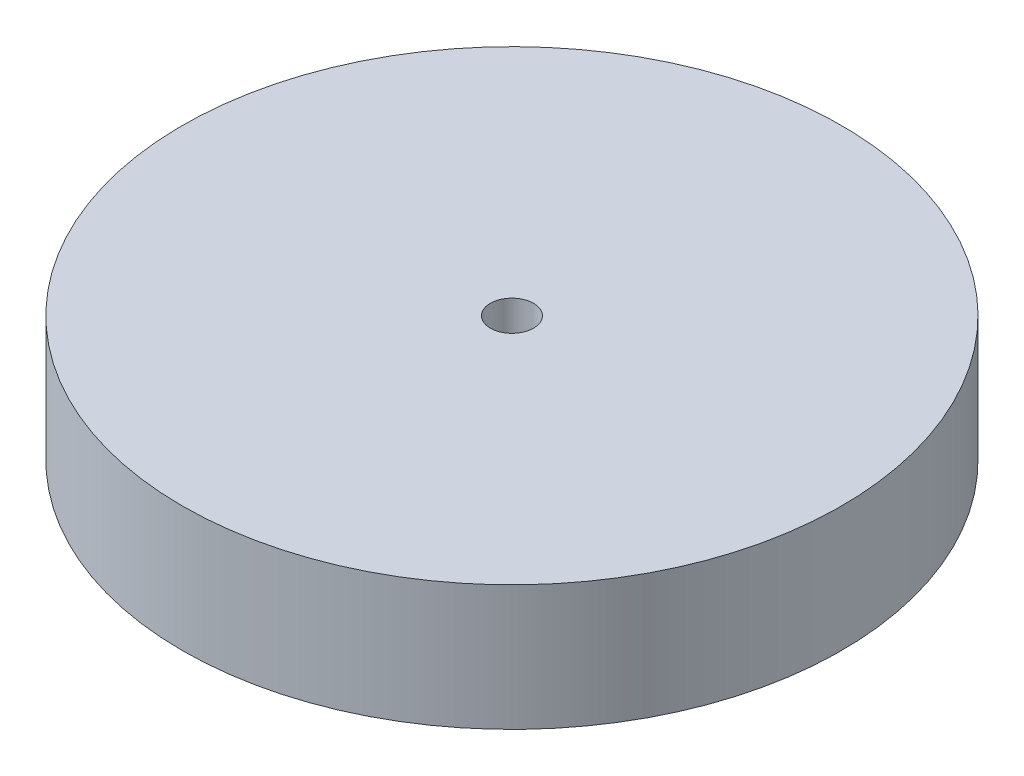
ISO-10303-21;
HEADER;
FILE_DESCRIPTION(('STEP AP214'),'2;1');
FILE_NAME('part.step','',(''),(''),'','','');
FILE_SCHEMA(('AUTOMOTIVE_DESIGN { 1 0 10303 214 1 1 1 1 }'));
ENDSEC;
DATA;
#1=APPLICATION_CONTEXT('core data for automotive mechanical design processes');
#2=APPLICATION_PROTOCOL_DEFINITION('international standard','automotive_design',2000,#1);
#3=PRODUCT_CONTEXT('',#1,'mechanical');
#4=PRODUCT('Part','Part','',(#3));
#5=PRODUCT_RELATED_PRODUCT_CATEGORY('part','',(#4));
#6=PRODUCT_DEFINITION_FORMATION('','',#4);
#7=PRODUCT_DEFINITION_CONTEXT('part definition',#1,'design');
#8=PRODUCT_DEFINITION('design','',#6,#7);
#9=PRODUCT_DEFINITION_SHAPE('','',#8);
#10=(LENGTH_UNIT() NAMED_UNIT(*) SI_UNIT(.MILLI.,.METRE.));
#11=(NAMED_UNIT(*) PLANE_ANGLE_UNIT() SI_UNIT($,.RADIAN.));
#12=(NAMED_UNIT(*) SI_UNIT($,.STERADIAN.) SOLID_ANGLE_UNIT());
#13=UNCERTAINTY_MEASURE_WITH_UNIT(LENGTH_MEASURE(1.E-05),#10,'distance_accuracy_value','');
#14=(GEOMETRIC_REPRESENTATION_CONTEXT(3) GLOBAL_UNCERTAINTY_ASSIGNED_CONTEXT((#13)) GLOBAL_UNIT_ASSIGNED_CONTEXT((#10,
#11,#12)) REPRESENTATION_CONTEXT('',''));
#15=CARTESIAN_POINT('',(0.,0.,0.));
#16=DIRECTION('',(0.,0.,1.));
#17=DIRECTION('',(1.,0.,0.));
#18=AXIS2_PLACEMENT_3D('',#15,#16,#17);
#19=CARTESIAN_POINT('',(0.,19.,0.));
#20=DIRECTION('',(0.,-1.,0.));
#21=DIRECTION('',(0.,0.,-1.));
#22=AXIS2_PLACEMENT_3D('',#19,#20,#21);
#23=CYLINDRICAL_SURFACE('',#22,50.);
#24=CARTESIAN_POINT('',(0.,19.,0.));
#25=DIRECTION('',(0.,1.,0.));
#26=DIRECTION('',(0.,0.,1.));
#27=AXIS2_PLACEMENT_3D('',#24,#25,#26);
#28=CIRCLE('',#27,50.);
#29=CARTESIAN_POINT('',(0.,19.,50.));
#30=VERTEX_POINT('',#29);
#31=EDGE_CURVE('E10',#30,#30,#28,.T.);
#32=ORIENTED_EDGE('',*,*,#31,.F.);
#33=EDGE_LOOP('',(#32));
#34=FACE_BOUND('',#33,.T.);
#35=CARTESIAN_POINT('',(0.,0.,0.));
#36=DIRECTION('',(0.,1.,0.));
#37=DIRECTION('',(0.,0.,1.));
#38=AXIS2_PLACEMENT_3D('',#35,#36,#37);
#39=CIRCLE('',#38,50.);
#40=CARTESIAN_POINT('',(0.,0.,50.));
#41=VERTEX_POINT('',#40);
#42=EDGE_CURVE('E36',#41,#41,#39,.T.);
#43=ORIENTED_EDGE('',*,*,#42,.T.);
#44=EDGE_LOOP('',(#43));
#45=FACE_BOUND('',#44,.T.);
#46=ADVANCED_FACE('F33',(#34,#45),#23,.T.);
#47=CARTESIAN_POINT('',(0.,19.,0.));
#48=DIRECTION('',(0.,1.,0.));
#49=DIRECTION('',(0.,0.,1.));
#50=AXIS2_PLACEMENT_3D('',#47,#48,#49);
#51=PLANE('',#50);
#52=CARTESIAN_POINT('',(0.,19.,0.));
#53=DIRECTION('',(0.,1.,0.));
#54=DIRECTION('',(0.,0.,1.));
#55=AXIS2_PLACEMENT_3D('',#52,#53,#54);
#56=CIRCLE('',#55,3.275);
#57=CARTESIAN_POINT('',(0.,19.,3.275));
#58=VERTEX_POINT('',#57);
#59=EDGE_CURVE('E45',#58,#58,#56,.T.);
#60=ORIENTED_EDGE('',*,*,#59,.F.);
#61=EDGE_LOOP('',(#60));
#62=FACE_BOUND('',#61,.T.);
#63=ORIENTED_EDGE('',*,*,#31,.T.);
#64=EDGE_LOOP('',(#63));
#65=FACE_BOUND('',#64,.T.);
#66=ADVANCED_FACE('F60',(#62,#65),#51,.T.);
#67=CARTESIAN_POINT('',(0.,0.,0.));
#68=DIRECTION('',(0.,1.,0.));
#69=DIRECTION('',(0.,0.,1.));
#70=AXIS2_PLACEMENT_3D('',#67,#68,#69);
#71=PLANE('',#70);
#72=CARTESIAN_POINT('',(0.,0.,0.));
#73=DIRECTION('',(0.,1.,0.));
#74=DIRECTION('',(0.,0.,1.));
#75=AXIS2_PLACEMENT_3D('',#72,#73,#74);
#76=CIRCLE('',#75,3.275);
#77=CARTESIAN_POINT('',(0.,0.,3.275));
#78=VERTEX_POINT('',#77);
#79=EDGE_CURVE('E43',#78,#78,#76,.T.);
#80=ORIENTED_EDGE('',*,*,#79,.T.);
#81=EDGE_LOOP('',(#80));
#82=FACE_BOUND('',#81,.T.);
#83=ORIENTED_EDGE('',*,*,#42,.F.);
#84=EDGE_LOOP('',(#83));
#85=FACE_BOUND('',#84,.T.);
#86=ADVANCED_FACE('F51',(#82,#85),#71,.F.);
#87=CARTESIAN_POINT('',(0.,0.,0.));
#88=DIRECTION('',(0.,1.,0.));
#89=DIRECTION('',(0.,0.,1.));
#90=AXIS2_PLACEMENT_3D('',#87,#88,#89);
#91=CYLINDRICAL_SURFACE('',#90,3.275);
#92=ORIENTED_EDGE('',*,*,#79,.F.);
#93=EDGE_LOOP('',(#92));
#94=FACE_BOUND('',#93,.T.);
#95=ORIENTED_EDGE('',*,*,#59,.T.);
#96=EDGE_LOOP('',(#95));
#97=FACE_BOUND('',#96,.T.);
#98=ADVANCED_FACE('F54',(#94,#97),#91,.F.);
#99=CLOSED_SHELL('',(#46,#66,#86,#98));
#100=MANIFOLD_SOLID_BREP('B2',#99);
#101=ADVANCED_BREP_SHAPE_REPRESENTATION('',(#18,#100),#14);
#102=SHAPE_DEFINITION_REPRESENTATION(#9,#101);
ENDSEC;
END-ISO-10303-21;
